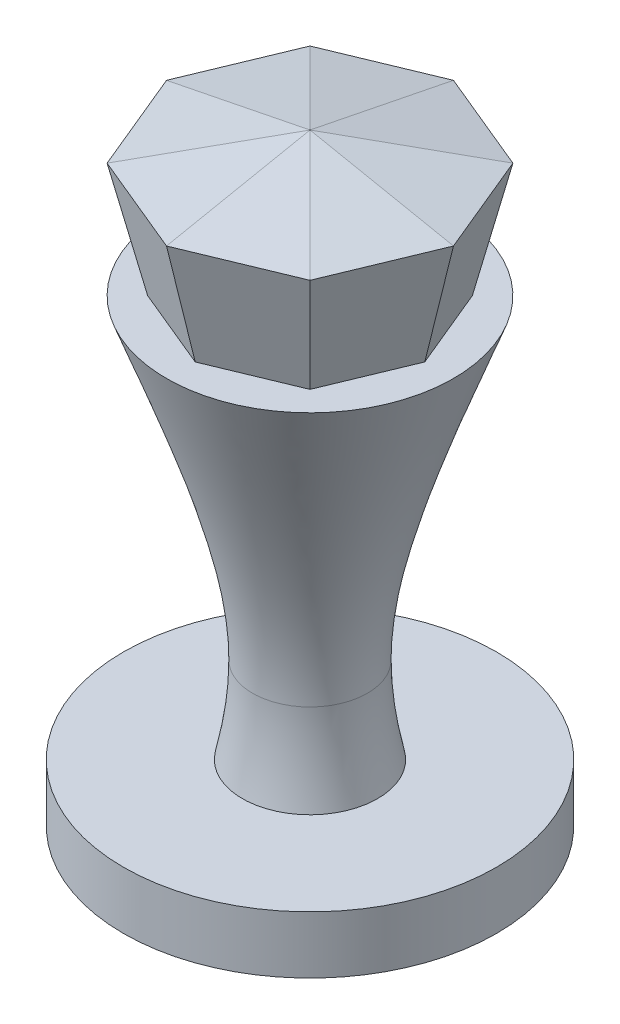
ISO-10303-21;
HEADER;
FILE_DESCRIPTION(('STEP AP214'),'2;1');
FILE_NAME('part.step','',(''),(''),'','','');
FILE_SCHEMA(('AUTOMOTIVE_DESIGN { 1 0 10303 214 1 1 1 1 }'));
ENDSEC;
DATA;
#1=APPLICATION_CONTEXT('core data for automotive mechanical design processes');
#2=APPLICATION_PROTOCOL_DEFINITION('international standard','automotive_design',2000,#1);
#3=PRODUCT_CONTEXT('',#1,'mechanical');
#4=PRODUCT('Part','Part','',(#3));
#5=PRODUCT_RELATED_PRODUCT_CATEGORY('part','',(#4));
#6=PRODUCT_DEFINITION_FORMATION('','',#4);
#7=PRODUCT_DEFINITION_CONTEXT('part definition',#1,'design');
#8=PRODUCT_DEFINITION('design','',#6,#7);
#9=PRODUCT_DEFINITION_SHAPE('','',#8);
#10=(LENGTH_UNIT() NAMED_UNIT(*) SI_UNIT(.MILLI.,.METRE.));
#11=(NAMED_UNIT(*) PLANE_ANGLE_UNIT() SI_UNIT($,.RADIAN.));
#12=(NAMED_UNIT(*) SI_UNIT($,.STERADIAN.) SOLID_ANGLE_UNIT());
#13=UNCERTAINTY_MEASURE_WITH_UNIT(LENGTH_MEASURE(1.E-05),#10,'distance_accuracy_value','');
#14=(GEOMETRIC_REPRESENTATION_CONTEXT(3) GLOBAL_UNCERTAINTY_ASSIGNED_CONTEXT((#13)) GLOBAL_UNIT_ASSIGNED_CONTEXT((#10,
#11,#12)) REPRESENTATION_CONTEXT('',''));
#15=CARTESIAN_POINT('',(0.,0.,0.));
#16=DIRECTION('',(0.,0.,1.));
#17=DIRECTION('',(1.,0.,0.));
#18=AXIS2_PLACEMENT_3D('',#15,#16,#17);
#19=CARTESIAN_POINT('',(100.,320.,0.));
#20=DIRECTION('',(0.,1.,0.));
#21=DIRECTION('',(0.,0.,1.));
#22=AXIS2_PLACEMENT_3D('',#19,#20,#21);
#23=PLANE('',#22);
#24=CARTESIAN_POINT('',(0.,320.,0.));
#25=DIRECTION('',(0.,-1.,0.));
#26=DIRECTION('',(0.,0.,-1.));
#27=AXIS2_PLACEMENT_3D('',#24,#25,#26);
#28=CIRCLE('',#27,100.);
#29=CARTESIAN_POINT('',(0.,320.,-100.));
#30=VERTEX_POINT('',#29);
#31=EDGE_CURVE('E162',#30,#30,#28,.T.);
#32=ORIENTED_EDGE('',*,*,#31,.F.);
#33=EDGE_LOOP('',(#32));
#34=FACE_BOUND('',#33,.T.);
#35=DIRECTION('',(-0.3826834323651,0.,-0.923879532511283));
#36=VECTOR('',#35,1.);
#37=CARTESIAN_POINT('',(80.,320.,-8.47403234585598E-13));
#38=LINE('',#37,#36);
#39=CARTESIAN_POINT('',(80.,320.,-8.46545056276682E-13));
#40=VERTEX_POINT('',#39);
#41=CARTESIAN_POINT('',(56.5685424949231,320.,-56.5685424949245));
#42=VERTEX_POINT('',#41);
#43=EDGE_CURVE('E173',#40,#42,#38,.T.);
#44=ORIENTED_EDGE('',*,*,#43,.F.);
#45=DIRECTION('',(0.38268343236508,0.,-0.923879532511291));
#46=VECTOR('',#45,1.);
#47=CARTESIAN_POINT('',(56.5685424949244,320.,56.5685424949232));
#48=LINE('',#47,#46);
#49=CARTESIAN_POINT('',(56.5685424949244,320.,56.5685424949232));
#50=VERTEX_POINT('',#49);
#51=EDGE_CURVE('E171',#50,#40,#48,.T.);
#52=ORIENTED_EDGE('',*,*,#51,.F.);
#53=DIRECTION('',(0.923879532511282,0.,-0.3826834323651));
#54=VECTOR('',#53,1.);
#55=CARTESIAN_POINT('',(8.51989135736393E-13,320.,80.));
#56=LINE('',#55,#54);
#57=CARTESIAN_POINT('',(8.51989135736393E-13,320.,80.));
#58=VERTEX_POINT('',#57);
#59=EDGE_CURVE('E160',#58,#50,#56,.T.);
#60=ORIENTED_EDGE('',*,*,#59,.F.);
#61=DIRECTION('',(0.923879532511291,0.,0.38268343236508));
#62=VECTOR('',#61,1.);
#63=CARTESIAN_POINT('',(-56.5685424949232,320.,56.5685424949244));
#64=LINE('',#63,#62);
#65=CARTESIAN_POINT('',(-56.5685424949232,320.,56.5685424949244));
#66=VERTEX_POINT('',#65);
#67=EDGE_CURVE('E146',#66,#58,#64,.T.);
#68=ORIENTED_EDGE('',*,*,#67,.F.);
#69=DIRECTION('',(0.3826834323651,0.,0.923879532511283));
#70=VECTOR('',#69,1.);
#71=CARTESIAN_POINT('',(-80.,320.,9.02047024078868E-13));
#72=LINE('',#71,#70);
#73=CARTESIAN_POINT('',(-80.,320.,9.02047024078868E-13));
#74=VERTEX_POINT('',#73);
#75=EDGE_CURVE('E136',#74,#66,#72,.T.);
#76=ORIENTED_EDGE('',*,*,#75,.F.);
#77=DIRECTION('',(-0.382683432365079,0.,0.923879532511291));
#78=VECTOR('',#77,1.);
#79=CARTESIAN_POINT('',(-56.5685424949245,320.,-56.5685424949232));
#80=LINE('',#79,#78);
#81=CARTESIAN_POINT('',(-56.5685424949245,320.,-56.5685424949232));
#82=VERTEX_POINT('',#81);
#83=EDGE_CURVE('E147',#82,#74,#80,.T.);
#84=ORIENTED_EDGE('',*,*,#83,.F.);
#85=DIRECTION('',(-0.923879532511283,0.,0.3826834323651));
#86=VECTOR('',#85,1.);
#87=CARTESIAN_POINT('',(-8.92199451251651E-13,320.,-80.));
#88=LINE('',#87,#86);
#89=CARTESIAN_POINT('',(-8.92199451251651E-13,320.,-80.));
#90=VERTEX_POINT('',#89);
#91=EDGE_CURVE('E376',#90,#82,#88,.T.);
#92=ORIENTED_EDGE('',*,*,#91,.F.);
#93=DIRECTION('',(-0.923879532511291,0.,-0.382683432365079));
#94=VECTOR('',#93,1.);
#95=CARTESIAN_POINT('',(56.5685424949231,320.,-56.5685424949245));
#96=LINE('',#95,#94);
#97=EDGE_CURVE('E374',#42,#90,#96,.T.);
#98=ORIENTED_EDGE('',*,*,#97,.F.);
#99=EDGE_LOOP('',(#44,#52,#60,#68,#76,#84,#92,#98));
#100=FACE_BOUND('',#99,.T.);
#101=ADVANCED_FACE('F57',(#34,#100),#23,.T.);
#102=CARTESIAN_POINT('',(0.,0.,0.));
#103=DIRECTION('',(0.,-1.,0.));
#104=DIRECTION('',(0.,0.,-1.));
#105=AXIS2_PLACEMENT_3D('',#102,#103,#104);
#106=PLANE('',#105);
#107=CARTESIAN_POINT('',(0.,0.,0.));
#108=DIRECTION('',(0.,-1.,0.));
#109=DIRECTION('',(0.,0.,-1.));
#110=AXIS2_PLACEMENT_3D('',#107,#108,#109);
#111=CIRCLE('',#110,130.);
#112=CARTESIAN_POINT('',(0.,0.,-130.));
#113=VERTEX_POINT('',#112);
#114=EDGE_CURVE('E12',#113,#113,#111,.T.);
#115=ORIENTED_EDGE('',*,*,#114,.T.);
#116=EDGE_LOOP('',(#115));
#117=FACE_BOUND('',#116,.T.);
#118=ADVANCED_FACE('F59',(#117),#106,.T.);
#119=CARTESIAN_POINT('',(0.,40.,0.));
#120=DIRECTION('',(0.,-1.,0.));
#121=DIRECTION('',(0.,0.,-1.));
#122=AXIS2_PLACEMENT_3D('',#119,#120,#121);
#123=CYLINDRICAL_SURFACE('',#122,130.);
#124=CARTESIAN_POINT('',(0.,40.,0.));
#125=DIRECTION('',(0.,-1.,0.));
#126=DIRECTION('',(0.,0.,-1.));
#127=AXIS2_PLACEMENT_3D('',#124,#125,#126);
#128=CIRCLE('',#127,130.);
#129=CARTESIAN_POINT('',(0.,40.,-130.));
#130=VERTEX_POINT('',#129);
#131=EDGE_CURVE('E66',#130,#130,#128,.T.);
#132=ORIENTED_EDGE('',*,*,#131,.T.);
#133=EDGE_LOOP('',(#132));
#134=FACE_BOUND('',#133,.T.);
#135=ORIENTED_EDGE('',*,*,#114,.F.);
#136=EDGE_LOOP('',(#135));
#137=FACE_BOUND('',#136,.T.);
#138=ADVANCED_FACE('F276',(#134,#137),#123,.T.);
#139=CARTESIAN_POINT('',(130.,40.,0.));
#140=DIRECTION('',(0.,1.,0.));
#141=DIRECTION('',(0.,0.,1.));
#142=AXIS2_PLACEMENT_3D('',#139,#140,#141);
#143=PLANE('',#142);
#144=CARTESIAN_POINT('',(0.,40.,0.));
#145=DIRECTION('',(0.,-1.,0.));
#146=DIRECTION('',(0.,0.,-1.));
#147=AXIS2_PLACEMENT_3D('',#144,#145,#146);
#148=CIRCLE('',#147,47.1657480810261);
#149=CARTESIAN_POINT('',(0.,40.,-47.1657480810261));
#150=VERTEX_POINT('',#149);
#151=EDGE_CURVE('E390',#150,#150,#148,.T.);
#152=ORIENTED_EDGE('',*,*,#151,.T.);
#153=EDGE_LOOP('',(#152));
#154=FACE_BOUND('',#153,.T.);
#155=ORIENTED_EDGE('',*,*,#131,.F.);
#156=EDGE_LOOP('',(#155));
#157=FACE_BOUND('',#156,.T.);
#158=ADVANCED_FACE('F272',(#154,#157),#143,.T.);
#159=CARTESIAN_POINT('',(47.1657480810261,40.,0.));
#160=CARTESIAN_POINT('',(46.7244443566941,42.0008927269761,0.));
#161=CARTESIAN_POINT('',(44.306079258287,53.3811951848979,0.));
#162=CARTESIAN_POINT('',(41.0510024731707,73.3207704680673,0.));
#163=CARTESIAN_POINT('',(39.9613532860088,91.4618625398434,0.));
#164=CARTESIAN_POINT('',(40.,100.,0.));
#165=B_SPLINE_CURVE_WITH_KNOTS('',3,(#159,#160,#161,#162,#163,#164),.UNSPECIFIED.,.F.,.F.,(4,1,
1,4),(0.616880522794384,0.639366291645382,0.744582671025348,0.838310590458955),.UNSPECIFIED.);
#166=CARTESIAN_POINT('',(0.,40.,0.));
#167=DIRECTION('',(0.,-1.,0.));
#168=AXIS1_PLACEMENT('',#166,#167);
#169=SURFACE_OF_REVOLUTION('',#165,#168);
#170=CARTESIAN_POINT('',(0.,100.,0.));
#171=DIRECTION('',(0.,-1.,0.));
#172=DIRECTION('',(0.,0.,-1.));
#173=AXIS2_PLACEMENT_3D('',#170,#171,#172);
#174=CIRCLE('',#173,40.);
#175=CARTESIAN_POINT('',(0.,100.,-40.));
#176=VERTEX_POINT('',#175);
#177=EDGE_CURVE('E393',#176,#176,#174,.T.);
#178=ORIENTED_EDGE('',*,*,#177,.T.);
#179=EDGE_LOOP('',(#178));
#180=FACE_BOUND('',#179,.T.);
#181=ORIENTED_EDGE('',*,*,#151,.F.);
#182=EDGE_LOOP('',(#181));
#183=FACE_BOUND('',#182,.T.);
#184=ADVANCED_FACE('F267',(#180,#183),#169,.F.);
#185=CARTESIAN_POINT('',(40.,100.,0.));
#186=CARTESIAN_POINT('',(39.9613527326282,108.538259717361,0.));
#187=CARTESIAN_POINT('',(41.0511571097063,126.679880209483,0.));
#188=CARTESIAN_POINT('',(45.9250290487347,156.537025107966,0.));
#189=CARTESIAN_POINT('',(62.7552759132225,222.327283942095,0.));
#190=CARTESIAN_POINT('',(84.0322482535679,276.75503243075,0.));
#191=CARTESIAN_POINT('',(100.,320.,0.));
#192=B_SPLINE_CURVE_WITH_KNOTS('',3,(#185,#186,#187,#188,#189,#190,#191),.UNSPECIFIED.,.F.,.F.,
(4,1,1,1,4),(0.,0.09372926151945,0.198947147487445,0.331611902787955,0.838310590458955),.UNSPECIFIED.);
#193=CARTESIAN_POINT('',(0.,40.,0.));
#194=DIRECTION('',(0.,-1.,0.));
#195=AXIS1_PLACEMENT('',#193,#194);
#196=SURFACE_OF_REVOLUTION('',#192,#195);
#197=ORIENTED_EDGE('',*,*,#31,.T.);
#198=EDGE_LOOP('',(#197));
#199=FACE_BOUND('',#198,.T.);
#200=ORIENTED_EDGE('',*,*,#177,.F.);
#201=EDGE_LOOP('',(#200));
#202=FACE_BOUND('',#201,.T.);
#203=ADVANCED_FACE('F271',(#199,#202),#196,.F.);
#204=CARTESIAN_POINT('',(70.7106781186555,400.,70.7106781186539));
#205=DIRECTION('',(-0.372866968059694,0.225045122812656,-0.90018049125062));
#206=DIRECTION('',(-0.923879532511282,0.,0.3826834323651));
#207=AXIS2_PLACEMENT_3D('',#204,#205,#206);
#208=PLANE('',#207);
#209=DIRECTION('',(0.171498585142511,0.970142500145332,0.171498585142507));
#210=VECTOR('',#209,1.);
#211=CARTESIAN_POINT('',(56.5685424949244,320.,56.5685424949232));
#212=LINE('',#211,#210);
#213=CARTESIAN_POINT('',(70.7106781186555,400.,70.7106781186539));
#214=VERTEX_POINT('',#213);
#215=EDGE_CURVE('E82',#50,#214,#212,.T.);
#216=ORIENTED_EDGE('',*,*,#215,.T.);
#217=DIRECTION('',(0.923879532511283,0.,-0.3826834323651));
#218=VECTOR('',#217,1.);
#219=CARTESIAN_POINT('',(1.11022302462516E-12,400.,100.));
#220=LINE('',#219,#218);
#221=CARTESIAN_POINT('',(1.11022302462516E-12,400.,100.));
#222=VERTEX_POINT('',#221);
#223=EDGE_CURVE('E194',#222,#214,#220,.T.);
#224=ORIENTED_EDGE('',*,*,#223,.F.);
#225=DIRECTION('',(0.,0.970142500145332,0.242535625036333));
#226=VECTOR('',#225,1.);
#227=CARTESIAN_POINT('',(8.51989135736393E-13,320.,80.));
#228=LINE('',#227,#226);
#229=EDGE_CURVE('E174',#58,#222,#228,.T.);
#230=ORIENTED_EDGE('',*,*,#229,.F.);
#231=ORIENTED_EDGE('',*,*,#59,.T.);
#232=EDGE_LOOP('',(#216,#224,#230,#231));
#233=FACE_BOUND('',#232,.T.);
#234=ADVANCED_FACE('F313',(#233),#208,.F.);
#235=CARTESIAN_POINT('',(1.11022302462516E-12,400.,100.));
#236=DIRECTION('',(0.372866968059674,0.225045122812656,-0.900180491250629));
#237=DIRECTION('',(-0.923879532511291,0.,-0.382683432365079));
#238=AXIS2_PLACEMENT_3D('',#235,#236,#237);
#239=PLANE('',#238);
#240=ORIENTED_EDGE('',*,*,#229,.T.);
#241=DIRECTION('',(0.923879532511291,0.,0.382683432365079));
#242=VECTOR('',#241,1.);
#243=CARTESIAN_POINT('',(-70.7106781186539,400.,70.7106781186556));
#244=LINE('',#243,#242);
#245=CARTESIAN_POINT('',(-70.7106781186539,400.,70.7106781186556));
#246=VERTEX_POINT('',#245);
#247=EDGE_CURVE('E154',#246,#222,#244,.T.);
#248=ORIENTED_EDGE('',*,*,#247,.F.);
#249=DIRECTION('',(-0.171498585142506,0.970142500145332,0.171498585142511));
#250=VECTOR('',#249,1.);
#251=CARTESIAN_POINT('',(-56.5685424949232,320.,56.5685424949244));
#252=LINE('',#251,#250);
#253=EDGE_CURVE('E139',#66,#246,#252,.T.);
#254=ORIENTED_EDGE('',*,*,#253,.F.);
#255=ORIENTED_EDGE('',*,*,#67,.T.);
#256=EDGE_LOOP('',(#240,#248,#254,#255));
#257=FACE_BOUND('',#256,.T.);
#258=ADVANCED_FACE('F151',(#257),#239,.F.);
#259=CARTESIAN_POINT('',(100.,400.,-1.12410081243297E-12));
#260=DIRECTION('',(-0.900180491250628,0.225045122812656,-0.372866968059674));
#261=DIRECTION('',(-0.382683432365079,0.,0.923879532511291));
#262=AXIS2_PLACEMENT_3D('',#259,#260,#261);
#263=PLANE('',#262);
#264=DIRECTION('',(0.242535625036333,0.970142500145332,0.));
#265=VECTOR('',#264,1.);
#266=CARTESIAN_POINT('',(80.,320.,-8.47403234585598E-13));
#267=LINE('',#266,#265);
#268=CARTESIAN_POINT('',(100.,400.,-1.12410081243297E-12));
#269=VERTEX_POINT('',#268);
#270=EDGE_CURVE('E74',#40,#269,#267,.T.);
#271=ORIENTED_EDGE('',*,*,#270,.T.);
#272=DIRECTION('',(0.382683432365079,0.,-0.923879532511291));
#273=VECTOR('',#272,1.);
#274=CARTESIAN_POINT('',(70.7106781186555,400.,70.7106781186539));
#275=LINE('',#274,#273);
#276=EDGE_CURVE('E189',#214,#269,#275,.T.);
#277=ORIENTED_EDGE('',*,*,#276,.F.);
#278=ORIENTED_EDGE('',*,*,#215,.F.);
#279=ORIENTED_EDGE('',*,*,#51,.T.);
#280=EDGE_LOOP('',(#271,#277,#278,#279));
#281=FACE_BOUND('',#280,.T.);
#282=ADVANCED_FACE('F308',(#281),#263,.F.);
#283=CARTESIAN_POINT('',(70.7106781186539,400.,-70.7106781186555));
#284=DIRECTION('',(-0.90018049125062,0.225045122812656,0.372866968059694));
#285=DIRECTION('',(0.3826834323651,0.,0.923879532511282));
#286=AXIS2_PLACEMENT_3D('',#283,#284,#285);
#287=PLANE('',#286);
#288=DIRECTION('',(0.171498585142508,0.970142500145332,-0.17149858514251));
#289=VECTOR('',#288,1.);
#290=CARTESIAN_POINT('',(56.5685424949231,320.,-56.5685424949245));
#291=LINE('',#290,#289);
#292=CARTESIAN_POINT('',(70.7106781186539,400.,-70.7106781186555));
#293=VERTEX_POINT('',#292);
#294=EDGE_CURVE('E237',#42,#293,#291,.T.);
#295=ORIENTED_EDGE('',*,*,#294,.T.);
#296=DIRECTION('',(-0.3826834323651,0.,-0.923879532511282));
#297=VECTOR('',#296,1.);
#298=CARTESIAN_POINT('',(100.,400.,-1.11022302462516E-12));
#299=LINE('',#298,#297);
#300=EDGE_CURVE('E184',#269,#293,#299,.T.);
#301=ORIENTED_EDGE('',*,*,#300,.F.);
#302=ORIENTED_EDGE('',*,*,#270,.F.);
#303=ORIENTED_EDGE('',*,*,#43,.T.);
#304=EDGE_LOOP('',(#295,#301,#302,#303));
#305=FACE_BOUND('',#304,.T.);
#306=ADVANCED_FACE('F305',(#305),#287,.F.);
#307=CARTESIAN_POINT('',(-1.13797860024079E-12,400.,-100.));
#308=DIRECTION('',(-0.372866968059674,0.225045122812656,0.900180491250628));
#309=DIRECTION('',(0.923879532511291,0.,0.38268343236508));
#310=AXIS2_PLACEMENT_3D('',#307,#308,#309);
#311=PLANE('',#310);
#312=DIRECTION('',(0.,0.970142500145332,-0.242535625036333));
#313=VECTOR('',#312,1.);
#314=CARTESIAN_POINT('',(-8.92199451251651E-13,320.,-80.));
#315=LINE('',#314,#313);
#316=CARTESIAN_POINT('',(-1.14459595434147E-12,400.,-100.));
#317=VERTEX_POINT('',#316);
#318=EDGE_CURVE('E111',#90,#317,#315,.T.);
#319=ORIENTED_EDGE('',*,*,#318,.T.);
#320=DIRECTION('',(-0.923879532511291,0.,-0.38268343236508));
#321=VECTOR('',#320,1.);
#322=CARTESIAN_POINT('',(70.7106781186539,400.,-70.7106781186555));
#323=LINE('',#322,#321);
#324=EDGE_CURVE('E179',#293,#317,#323,.T.);
#325=ORIENTED_EDGE('',*,*,#324,.F.);
#326=ORIENTED_EDGE('',*,*,#294,.F.);
#327=ORIENTED_EDGE('',*,*,#97,.T.);
#328=EDGE_LOOP('',(#319,#325,#326,#327));
#329=FACE_BOUND('',#328,.T.);
#330=ADVANCED_FACE('F302',(#329),#311,.F.);
#331=CARTESIAN_POINT('',(-70.7106781186555,400.,-70.7106781186539));
#332=DIRECTION('',(0.372866968059694,0.225045122812656,0.90018049125062));
#333=DIRECTION('',(0.923879532511282,0.,-0.382683432365101));
#334=AXIS2_PLACEMENT_3D('',#331,#332,#333);
#335=PLANE('',#334);
#336=DIRECTION('',(-0.17149858514251,0.970142500145332,-0.171498585142507));
#337=VECTOR('',#336,1.);
#338=CARTESIAN_POINT('',(-56.5685424949245,320.,-56.5685424949232));
#339=LINE('',#338,#337);
#340=CARTESIAN_POINT('',(-70.7106781186555,400.,-70.7106781186539));
#341=VERTEX_POINT('',#340);
#342=EDGE_CURVE('E119',#82,#341,#339,.T.);
#343=ORIENTED_EDGE('',*,*,#342,.T.);
#344=DIRECTION('',(-0.923879532511282,0.,0.382683432365101));
#345=VECTOR('',#344,1.);
#346=CARTESIAN_POINT('',(-1.14459595434147E-12,400.,-100.));
#347=LINE('',#346,#345);
#348=EDGE_CURVE('E155',#317,#341,#347,.T.);
#349=ORIENTED_EDGE('',*,*,#348,.F.);
#350=ORIENTED_EDGE('',*,*,#318,.F.);
#351=ORIENTED_EDGE('',*,*,#91,.T.);
#352=EDGE_LOOP('',(#343,#349,#350,#351));
#353=FACE_BOUND('',#352,.T.);
#354=ADVANCED_FACE('F298',(#353),#335,.F.);
#355=CARTESIAN_POINT('',(-100.,400.,1.12410081243297E-12));
#356=DIRECTION('',(0.900180491250629,0.225045122812656,0.372866968059674));
#357=DIRECTION('',(0.382683432365079,0.,-0.923879532511291));
#358=AXIS2_PLACEMENT_3D('',#355,#356,#357);
#359=PLANE('',#358);
#360=DIRECTION('',(-0.242535625036332,0.970142500145332,0.));
#361=VECTOR('',#360,1.);
#362=CARTESIAN_POINT('',(-80.,320.,9.02047024078868E-13));
#363=LINE('',#362,#361);
#364=CARTESIAN_POINT('',(-100.,400.,1.12410081243297E-12));
#365=VERTEX_POINT('',#364);
#366=EDGE_CURVE('E142',#74,#365,#363,.T.);
#367=ORIENTED_EDGE('',*,*,#366,.T.);
#368=DIRECTION('',(-0.38268343236508,0.,0.923879532511291));
#369=VECTOR('',#368,1.);
#370=CARTESIAN_POINT('',(-70.7106781186555,400.,-70.7106781186539));
#371=LINE('',#370,#369);
#372=EDGE_CURVE('E206',#341,#365,#371,.T.);
#373=ORIENTED_EDGE('',*,*,#372,.F.);
#374=ORIENTED_EDGE('',*,*,#342,.F.);
#375=ORIENTED_EDGE('',*,*,#83,.T.);
#376=EDGE_LOOP('',(#367,#373,#374,#375));
#377=FACE_BOUND('',#376,.T.);
#378=ADVANCED_FACE('F295',(#377),#359,.F.);
#379=CARTESIAN_POINT('',(-70.7106781186539,400.,70.7106781186556));
#380=DIRECTION('',(0.90018049125062,0.225045122812655,-0.372866968059694));
#381=DIRECTION('',(-0.382683432365101,0.,-0.923879532511282));
#382=AXIS2_PLACEMENT_3D('',#379,#380,#381);
#383=PLANE('',#382);
#384=ORIENTED_EDGE('',*,*,#253,.T.);
#385=DIRECTION('',(0.382683432365101,0.,0.923879532511282));
#386=VECTOR('',#385,1.);
#387=CARTESIAN_POINT('',(-100.,400.,1.11022302462516E-12));
#388=LINE('',#387,#386);
#389=EDGE_CURVE('E202',#365,#246,#388,.T.);
#390=ORIENTED_EDGE('',*,*,#389,.F.);
#391=ORIENTED_EDGE('',*,*,#366,.F.);
#392=ORIENTED_EDGE('',*,*,#75,.T.);
#393=EDGE_LOOP('',(#384,#390,#391,#392));
#394=FACE_BOUND('',#393,.T.);
#395=ADVANCED_FACE('F138',(#394),#383,.F.);
#396=CARTESIAN_POINT('',(-100.,400.,1.12105227997719E-12));
#397=DIRECTION('',(-0.195472239226491,0.977361196132457,0.0809672525550533));
#398=DIRECTION('',(-0.98058067569092,-0.196116135138183,0.));
#399=AXIS2_PLACEMENT_3D('',#396,#397,#398);
#400=PLANE('',#399);
#401=DIRECTION('',(-0.98058067569092,-0.196116135138184,0.));
#402=VECTOR('',#401,1.);
#403=CARTESIAN_POINT('',(0.,420.,0.));
#404=LINE('',#403,#402);
#405=CARTESIAN_POINT('',(0.,420.,0.));
#406=VERTEX_POINT('',#405);
#407=EDGE_CURVE('E215',#406,#365,#404,.T.);
#408=ORIENTED_EDGE('',*,*,#407,.T.);
#409=ORIENTED_EDGE('',*,*,#389,.T.);
#410=DIRECTION('',(-0.693375245281528,-0.196116135138184,0.693375245281545));
#411=VECTOR('',#410,1.);
#412=CARTESIAN_POINT('',(0.,420.,0.));
#413=LINE('',#412,#411);
#414=EDGE_CURVE('E209',#406,#246,#413,.T.);
#415=ORIENTED_EDGE('',*,*,#414,.F.);
#416=EDGE_LOOP('',(#408,#409,#415));
#417=FACE_BOUND('',#416,.T.);
#418=ADVANCED_FACE('F294',(#417),#400,.T.);
#419=CARTESIAN_POINT('',(-70.7106781186538,400.,70.7106781186556));
#420=DIRECTION('',(-0.0809672525550488,0.977361196132457,0.195472239226493));
#421=DIRECTION('',(0.,-0.196116135138185,0.98058067569092));
#422=AXIS2_PLACEMENT_3D('',#419,#420,#421);
#423=PLANE('',#422);
#424=ORIENTED_EDGE('',*,*,#414,.T.);
#425=ORIENTED_EDGE('',*,*,#247,.T.);
#426=DIRECTION('',(0.,-0.196116135138184,0.98058067569092));
#427=VECTOR('',#426,1.);
#428=CARTESIAN_POINT('',(0.,420.,0.));
#429=LINE('',#428,#427);
#430=EDGE_CURVE('E365',#406,#222,#429,.T.);
#431=ORIENTED_EDGE('',*,*,#430,.F.);
#432=EDGE_LOOP('',(#424,#425,#431));
#433=FACE_BOUND('',#432,.T.);
#434=ADVANCED_FACE('F340',(#433),#423,.T.);
#435=CARTESIAN_POINT('',(-70.7106781186555,400.,-70.7106781186539));
#436=DIRECTION('',(-0.195472239226493,0.977361196132457,-0.0809672525550488));
#437=DIRECTION('',(-0.98058067569092,-0.196116135138185,0.));
#438=AXIS2_PLACEMENT_3D('',#435,#436,#437);
#439=PLANE('',#438);
#440=DIRECTION('',(-0.693375245281544,-0.196116135138184,-0.693375245281529));
#441=VECTOR('',#440,1.);
#442=CARTESIAN_POINT('',(0.,420.,0.));
#443=LINE('',#442,#441);
#444=EDGE_CURVE('E220',#406,#341,#443,.T.);
#445=ORIENTED_EDGE('',*,*,#444,.T.);
#446=ORIENTED_EDGE('',*,*,#372,.T.);
#447=ORIENTED_EDGE('',*,*,#407,.F.);
#448=EDGE_LOOP('',(#445,#446,#447));
#449=FACE_BOUND('',#448,.T.);
#450=ADVANCED_FACE('F336',(#449),#439,.T.);
#451=CARTESIAN_POINT('',(-1.15440903220824E-12,400.,-100.));
#452=DIRECTION('',(-0.0809672525550533,0.977361196132457,-0.195472239226491));
#453=DIRECTION('',(0.,0.196116135138183,0.98058067569092));
#454=AXIS2_PLACEMENT_3D('',#451,#452,#453);
#455=PLANE('',#454);
#456=DIRECTION('',(0.,-0.196116135138184,-0.98058067569092));
#457=VECTOR('',#456,1.);
#458=CARTESIAN_POINT('',(0.,420.,0.));
#459=LINE('',#458,#457);
#460=EDGE_CURVE('E349',#406,#317,#459,.T.);
#461=ORIENTED_EDGE('',*,*,#460,.T.);
#462=ORIENTED_EDGE('',*,*,#348,.T.);
#463=ORIENTED_EDGE('',*,*,#444,.F.);
#464=EDGE_LOOP('',(#461,#462,#463));
#465=FACE_BOUND('',#464,.T.);
#466=ADVANCED_FACE('F332',(#465),#455,.T.);
#467=CARTESIAN_POINT('',(70.7106781186539,400.,-70.7106781186555));
#468=DIRECTION('',(0.0809672525550488,0.977361196132457,-0.195472239226493));
#469=DIRECTION('',(0.,0.196116135138185,0.98058067569092));
#470=AXIS2_PLACEMENT_3D('',#467,#468,#469);
#471=PLANE('',#470);
#472=DIRECTION('',(0.693375245281529,-0.196116135138184,-0.693375245281544));
#473=VECTOR('',#472,1.);
#474=CARTESIAN_POINT('',(0.,420.,0.));
#475=LINE('',#474,#473);
#476=EDGE_CURVE('E355',#406,#293,#475,.T.);
#477=ORIENTED_EDGE('',*,*,#476,.T.);
#478=ORIENTED_EDGE('',*,*,#324,.T.);
#479=ORIENTED_EDGE('',*,*,#460,.F.);
#480=EDGE_LOOP('',(#477,#478,#479));
#481=FACE_BOUND('',#480,.T.);
#482=ADVANCED_FACE('F328',(#481),#471,.T.);
#483=CARTESIAN_POINT('',(100.,400.,-1.12524027291986E-12));
#484=DIRECTION('',(0.195472239226491,0.977361196132457,-0.0809672525550532));
#485=DIRECTION('',(-0.98058067569092,0.196116135138183,0.));
#486=AXIS2_PLACEMENT_3D('',#483,#484,#485);
#487=PLANE('',#486);
#488=DIRECTION('',(0.98058067569092,-0.196116135138184,0.));
#489=VECTOR('',#488,1.);
#490=CARTESIAN_POINT('',(0.,420.,0.));
#491=LINE('',#490,#489);
#492=EDGE_CURVE('E360',#406,#269,#491,.T.);
#493=ORIENTED_EDGE('',*,*,#492,.T.);
#494=ORIENTED_EDGE('',*,*,#300,.T.);
#495=ORIENTED_EDGE('',*,*,#476,.F.);
#496=EDGE_LOOP('',(#493,#494,#495));
#497=FACE_BOUND('',#496,.T.);
#498=ADVANCED_FACE('F324',(#497),#487,.T.);
#499=CARTESIAN_POINT('',(70.7106781186555,400.,70.7106781186539));
#500=DIRECTION('',(0.195472239226493,0.977361196132457,0.0809672525550487));
#501=DIRECTION('',(-0.98058067569092,0.196116135138185,0.));
#502=AXIS2_PLACEMENT_3D('',#499,#500,#501);
#503=PLANE('',#502);
#504=DIRECTION('',(0.693375245281544,-0.196116135138184,0.693375245281529));
#505=VECTOR('',#504,1.);
#506=CARTESIAN_POINT('',(0.,420.,0.));
#507=LINE('',#506,#505);
#508=EDGE_CURVE('E362',#406,#214,#507,.T.);
#509=ORIENTED_EDGE('',*,*,#508,.T.);
#510=ORIENTED_EDGE('',*,*,#276,.T.);
#511=ORIENTED_EDGE('',*,*,#492,.F.);
#512=EDGE_LOOP('',(#509,#510,#511));
#513=FACE_BOUND('',#512,.T.);
#514=ADVANCED_FACE('F320',(#513),#503,.T.);
#515=CARTESIAN_POINT('',(1.12003610249193E-12,400.,100.));
#516=DIRECTION('',(0.0809672525550531,0.977361196132457,0.195472239226491));
#517=DIRECTION('',(0.,-0.196116135138183,0.98058067569092));
#518=AXIS2_PLACEMENT_3D('',#515,#516,#517);
#519=PLANE('',#518);
#520=ORIENTED_EDGE('',*,*,#430,.T.);
#521=ORIENTED_EDGE('',*,*,#223,.T.);
#522=ORIENTED_EDGE('',*,*,#508,.F.);
#523=EDGE_LOOP('',(#520,#521,#522));
#524=FACE_BOUND('',#523,.T.);
#525=ADVANCED_FACE('F317',(#524),#519,.T.);
#526=CLOSED_SHELL('',(#101,#118,#138,#158,#184,#203,#234,#258,#282,#306,#330,#354,#378,#395,
#418,#434,#450,#466,#482,#498,#514,#525));
#527=MANIFOLD_SOLID_BREP('B2',#526);
#528=ADVANCED_BREP_SHAPE_REPRESENTATION('',(#18,#527),#14);
#529=SHAPE_DEFINITION_REPRESENTATION(#9,#528);
ENDSEC;
END-ISO-10303-21;
